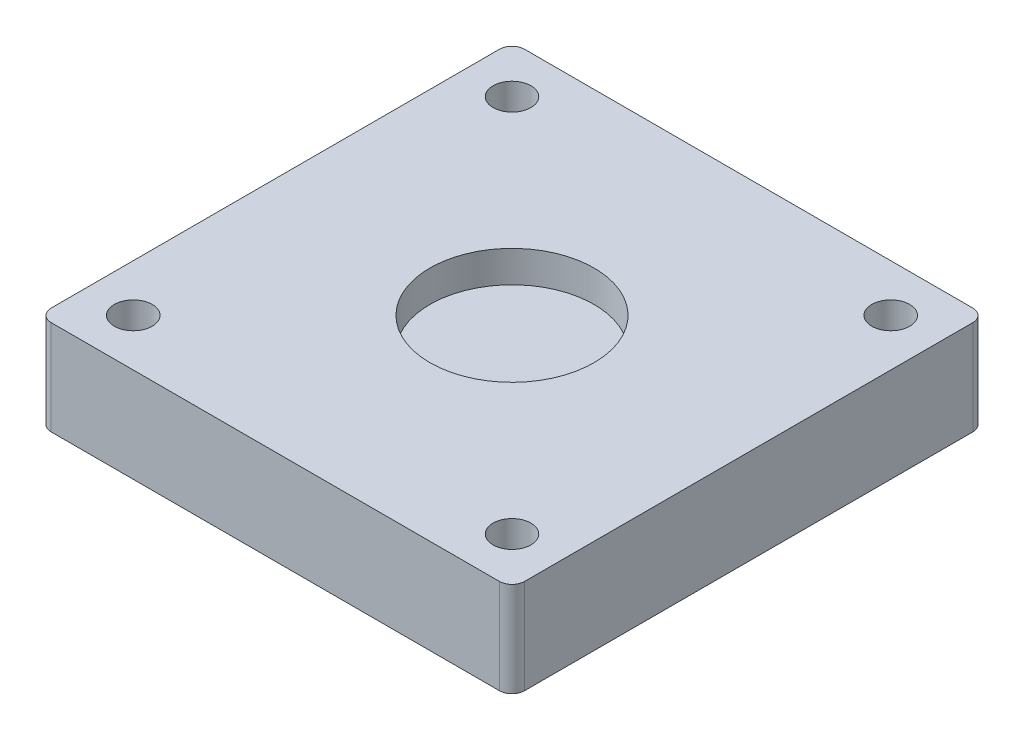
ISO-10303-21;
HEADER;
FILE_DESCRIPTION(('STEP AP214'),'2;1');
FILE_NAME('part.step','',(''),(''),'','','');
FILE_SCHEMA(('AUTOMOTIVE_DESIGN { 1 0 10303 214 1 1 1 1 }'));
ENDSEC;
DATA;
#1=APPLICATION_CONTEXT('core data for automotive mechanical design processes');
#2=APPLICATION_PROTOCOL_DEFINITION('international standard','automotive_design',2000,#1);
#3=PRODUCT_CONTEXT('',#1,'mechanical');
#4=PRODUCT('Part','Part','',(#3));
#5=PRODUCT_RELATED_PRODUCT_CATEGORY('part','',(#4));
#6=PRODUCT_DEFINITION_FORMATION('','',#4);
#7=PRODUCT_DEFINITION_CONTEXT('part definition',#1,'design');
#8=PRODUCT_DEFINITION('design','',#6,#7);
#9=PRODUCT_DEFINITION_SHAPE('','',#8);
#10=(LENGTH_UNIT() NAMED_UNIT(*) SI_UNIT(.MILLI.,.METRE.));
#11=(NAMED_UNIT(*) PLANE_ANGLE_UNIT() SI_UNIT($,.RADIAN.));
#12=(NAMED_UNIT(*) SI_UNIT($,.STERADIAN.) SOLID_ANGLE_UNIT());
#13=UNCERTAINTY_MEASURE_WITH_UNIT(LENGTH_MEASURE(1.E-05),#10,'distance_accuracy_value','');
#14=(GEOMETRIC_REPRESENTATION_CONTEXT(3) GLOBAL_UNCERTAINTY_ASSIGNED_CONTEXT((#13)) GLOBAL_UNIT_ASSIGNED_CONTEXT((#10,
#11,#12)) REPRESENTATION_CONTEXT('',''));
#15=CARTESIAN_POINT('',(0.,0.,0.));
#16=DIRECTION('',(0.,0.,1.));
#17=DIRECTION('',(1.,0.,0.));
#18=AXIS2_PLACEMENT_3D('',#15,#16,#17);
#19=CARTESIAN_POINT('',(37.5,7.5,37.5));
#20=DIRECTION('',(-1.,0.,0.));
#21=DIRECTION('',(0.,0.,1.));
#22=AXIS2_PLACEMENT_3D('',#19,#20,#21);
#23=PLANE('',#22);
#24=DIRECTION('',(0.,0.,-1.));
#25=VECTOR('',#24,1.);
#26=CARTESIAN_POINT('',(37.5,7.5,37.5));
#27=LINE('',#26,#25);
#28=CARTESIAN_POINT('',(37.5,7.5,35.5));
#29=VERTEX_POINT('',#28);
#30=CARTESIAN_POINT('',(37.5,7.5,-35.5));
#31=VERTEX_POINT('',#30);
#32=EDGE_CURVE('E146',#29,#31,#27,.T.);
#33=ORIENTED_EDGE('',*,*,#32,.F.);
#34=DIRECTION('',(0.,1.,0.));
#35=VECTOR('',#34,1.);
#36=CARTESIAN_POINT('',(37.5,-7.5,35.5));
#37=LINE('',#36,#35);
#38=CARTESIAN_POINT('',(37.5,-7.5,35.5));
#39=VERTEX_POINT('',#38);
#40=EDGE_CURVE('E103',#29,#39,#37,.F.);
#41=ORIENTED_EDGE('',*,*,#40,.T.);
#42=DIRECTION('',(0.,0.,-1.));
#43=VECTOR('',#42,1.);
#44=CARTESIAN_POINT('',(37.5,-7.5,37.5));
#45=LINE('',#44,#43);
#46=CARTESIAN_POINT('',(37.5,-7.5,-35.5));
#47=VERTEX_POINT('',#46);
#48=EDGE_CURVE('E127',#39,#47,#45,.T.);
#49=ORIENTED_EDGE('',*,*,#48,.T.);
#50=DIRECTION('',(0.,1.,0.));
#51=VECTOR('',#50,1.);
#52=CARTESIAN_POINT('',(37.5,7.5,-35.5));
#53=LINE('',#52,#51);
#54=EDGE_CURVE('E108',#47,#31,#53,.T.);
#55=ORIENTED_EDGE('',*,*,#54,.T.);
#56=EDGE_LOOP('',(#33,#41,#49,#55));
#57=FACE_BOUND('',#56,.T.);
#58=ADVANCED_FACE('F32',(#57),#23,.F.);
#59=CARTESIAN_POINT('',(-37.5,7.5,37.5));
#60=DIRECTION('',(0.,-1.,0.));
#61=DIRECTION('',(0.,0.,-1.));
#62=AXIS2_PLACEMENT_3D('',#59,#60,#61);
#63=PLANE('',#62);
#64=CARTESIAN_POINT('',(-30.,7.5,-30.));
#65=DIRECTION('',(0.,1.,0.));
#66=DIRECTION('',(0.,0.,1.));
#67=AXIS2_PLACEMENT_3D('',#64,#65,#66);
#68=CIRCLE('',#67,3.);
#69=CARTESIAN_POINT('',(-30.,7.5,-27.));
#70=VERTEX_POINT('',#69);
#71=EDGE_CURVE('E434',#70,#70,#68,.T.);
#72=ORIENTED_EDGE('',*,*,#71,.F.);
#73=EDGE_LOOP('',(#72));
#74=FACE_BOUND('',#73,.T.);
#75=CARTESIAN_POINT('',(-30.,7.5,30.));
#76=DIRECTION('',(0.,1.,0.));
#77=DIRECTION('',(0.,0.,-1.));
#78=AXIS2_PLACEMENT_3D('',#75,#76,#77);
#79=CIRCLE('',#78,3.);
#80=CARTESIAN_POINT('',(-30.,7.5,27.));
#81=VERTEX_POINT('',#80);
#82=EDGE_CURVE('E440',#81,#81,#79,.T.);
#83=ORIENTED_EDGE('',*,*,#82,.F.);
#84=EDGE_LOOP('',(#83));
#85=FACE_BOUND('',#84,.T.);
#86=CARTESIAN_POINT('',(30.,7.5,30.));
#87=DIRECTION('',(0.,1.,0.));
#88=DIRECTION('',(0.,0.,1.));
#89=AXIS2_PLACEMENT_3D('',#86,#87,#88);
#90=CIRCLE('',#89,3.);
#91=CARTESIAN_POINT('',(30.,7.5,33.));
#92=VERTEX_POINT('',#91);
#93=EDGE_CURVE('E446',#92,#92,#90,.T.);
#94=ORIENTED_EDGE('',*,*,#93,.F.);
#95=EDGE_LOOP('',(#94));
#96=FACE_BOUND('',#95,.T.);
#97=CARTESIAN_POINT('',(30.,7.5,-30.));
#98=DIRECTION('',(0.,1.,0.));
#99=DIRECTION('',(0.,0.,-1.));
#100=AXIS2_PLACEMENT_3D('',#97,#98,#99);
#101=CIRCLE('',#100,3.);
#102=CARTESIAN_POINT('',(30.,7.5,-33.));
#103=VERTEX_POINT('',#102);
#104=EDGE_CURVE('E419',#103,#103,#101,.T.);
#105=ORIENTED_EDGE('',*,*,#104,.F.);
#106=EDGE_LOOP('',(#105));
#107=FACE_BOUND('',#106,.T.);
#108=CARTESIAN_POINT('',(0.,7.5,0.));
#109=DIRECTION('',(0.,1.,0.));
#110=DIRECTION('',(0.,0.,1.));
#111=AXIS2_PLACEMENT_3D('',#108,#109,#110);
#112=CIRCLE('',#111,13.);
#113=CARTESIAN_POINT('',(0.,7.5,13.));
#114=VERTEX_POINT('',#113);
#115=EDGE_CURVE('E133',#114,#114,#112,.T.);
#116=ORIENTED_EDGE('',*,*,#115,.F.);
#117=EDGE_LOOP('',(#116));
#118=FACE_BOUND('',#117,.T.);
#119=DIRECTION('',(-1.,0.,0.));
#120=VECTOR('',#119,1.);
#121=CARTESIAN_POINT('',(-37.5,7.5,37.5));
#122=LINE('',#121,#120);
#123=CARTESIAN_POINT('',(35.5,7.5,37.5));
#124=VERTEX_POINT('',#123);
#125=CARTESIAN_POINT('',(-35.5,7.5,37.5));
#126=VERTEX_POINT('',#125);
#127=EDGE_CURVE('E116',#124,#126,#122,.T.);
#128=ORIENTED_EDGE('',*,*,#127,.F.);
#129=CARTESIAN_POINT('',(35.5,7.5,35.5));
#130=DIRECTION('',(0.,-1.,0.));
#131=DIRECTION('',(0.,0.,-1.));
#132=AXIS2_PLACEMENT_3D('',#129,#130,#131);
#133=CIRCLE('',#132,2.);
#134=EDGE_CURVE('E98',#124,#29,#133,.F.);
#135=ORIENTED_EDGE('',*,*,#134,.T.);
#136=ORIENTED_EDGE('',*,*,#32,.T.);
#137=CARTESIAN_POINT('',(35.5,7.5,-35.5));
#138=DIRECTION('',(0.,-1.,0.));
#139=DIRECTION('',(0.,0.,-1.));
#140=AXIS2_PLACEMENT_3D('',#137,#138,#139);
#141=CIRCLE('',#140,2.);
#142=CARTESIAN_POINT('',(35.5,7.5,-37.5));
#143=VERTEX_POINT('',#142);
#144=EDGE_CURVE('E109',#31,#143,#141,.F.);
#145=ORIENTED_EDGE('',*,*,#144,.T.);
#146=DIRECTION('',(-1.,0.,0.));
#147=VECTOR('',#146,1.);
#148=CARTESIAN_POINT('',(-37.5,7.5,-37.5));
#149=LINE('',#148,#147);
#150=CARTESIAN_POINT('',(-35.5,7.5,-37.5));
#151=VERTEX_POINT('',#150);
#152=EDGE_CURVE('E130',#143,#151,#149,.T.);
#153=ORIENTED_EDGE('',*,*,#152,.T.);
#154=CARTESIAN_POINT('',(-35.5,7.5,-35.5));
#155=DIRECTION('',(0.,-1.,0.));
#156=DIRECTION('',(0.,0.,-1.));
#157=AXIS2_PLACEMENT_3D('',#154,#155,#156);
#158=CIRCLE('',#157,2.);
#159=CARTESIAN_POINT('',(-37.5,7.5,-35.5));
#160=VERTEX_POINT('',#159);
#161=EDGE_CURVE('E150',#151,#160,#158,.F.);
#162=ORIENTED_EDGE('',*,*,#161,.T.);
#163=DIRECTION('',(0.,0.,-1.));
#164=VECTOR('',#163,1.);
#165=CARTESIAN_POINT('',(-37.5,7.5,37.5));
#166=LINE('',#165,#164);
#167=CARTESIAN_POINT('',(-37.5,7.5,35.5));
#168=VERTEX_POINT('',#167);
#169=EDGE_CURVE('E143',#168,#160,#166,.T.);
#170=ORIENTED_EDGE('',*,*,#169,.F.);
#171=CARTESIAN_POINT('',(-35.5,7.5,35.5));
#172=DIRECTION('',(0.,-1.,0.));
#173=DIRECTION('',(0.,0.,-1.));
#174=AXIS2_PLACEMENT_3D('',#171,#172,#173);
#175=CIRCLE('',#174,2.);
#176=EDGE_CURVE('E119',#168,#126,#175,.F.);
#177=ORIENTED_EDGE('',*,*,#176,.T.);
#178=EDGE_LOOP('',(#128,#135,#136,#145,#153,#162,#170,#177));
#179=FACE_BOUND('',#178,.T.);
#180=ADVANCED_FACE('F122',(#74,#85,#96,#107,#118,#179),#63,.F.);
#181=CARTESIAN_POINT('',(-37.5,7.5,37.5));
#182=DIRECTION('',(1.,0.,0.));
#183=DIRECTION('',(0.,1.,0.));
#184=AXIS2_PLACEMENT_3D('',#181,#182,#183);
#185=PLANE('',#184);
#186=ORIENTED_EDGE('',*,*,#169,.T.);
#187=DIRECTION('',(0.,-1.,0.));
#188=VECTOR('',#187,1.);
#189=CARTESIAN_POINT('',(-37.5,7.5,-35.5));
#190=LINE('',#189,#188);
#191=CARTESIAN_POINT('',(-37.5,-7.5,-35.5));
#192=VERTEX_POINT('',#191);
#193=EDGE_CURVE('E11',#160,#192,#190,.T.);
#194=ORIENTED_EDGE('',*,*,#193,.T.);
#195=DIRECTION('',(0.,0.,-1.));
#196=VECTOR('',#195,1.);
#197=CARTESIAN_POINT('',(-37.5,-7.5,37.5));
#198=LINE('',#197,#196);
#199=CARTESIAN_POINT('',(-37.5,-7.5,35.5));
#200=VERTEX_POINT('',#199);
#201=EDGE_CURVE('E141',#200,#192,#198,.T.);
#202=ORIENTED_EDGE('',*,*,#201,.F.);
#203=DIRECTION('',(0.,-1.,0.));
#204=VECTOR('',#203,1.);
#205=CARTESIAN_POINT('',(-37.5,7.5,35.5));
#206=LINE('',#205,#204);
#207=EDGE_CURVE('E40',#200,#168,#206,.F.);
#208=ORIENTED_EDGE('',*,*,#207,.T.);
#209=EDGE_LOOP('',(#186,#194,#202,#208));
#210=FACE_BOUND('',#209,.T.);
#211=ADVANCED_FACE('F167',(#210),#185,.F.);
#212=CARTESIAN_POINT('',(-37.5,-7.5,37.5));
#213=DIRECTION('',(0.,1.,0.));
#214=DIRECTION('',(0.,0.,1.));
#215=AXIS2_PLACEMENT_3D('',#212,#213,#214);
#216=PLANE('',#215);
#217=CARTESIAN_POINT('',(30.,-7.5,-30.));
#218=DIRECTION('',(0.,1.,0.));
#219=DIRECTION('',(0.,0.,1.));
#220=AXIS2_PLACEMENT_3D('',#217,#218,#219);
#221=CIRCLE('',#220,2.);
#222=CARTESIAN_POINT('',(30.,-7.5,-28.));
#223=VERTEX_POINT('',#222);
#224=EDGE_CURVE('E407',#223,#223,#221,.T.);
#225=ORIENTED_EDGE('',*,*,#224,.T.);
#226=EDGE_LOOP('',(#225));
#227=FACE_BOUND('',#226,.T.);
#228=CARTESIAN_POINT('',(30.,-7.5,30.));
#229=DIRECTION('',(0.,1.,0.));
#230=DIRECTION('',(0.,0.,1.));
#231=AXIS2_PLACEMENT_3D('',#228,#229,#230);
#232=CIRCLE('',#231,2.);
#233=CARTESIAN_POINT('',(30.,-7.5,32.));
#234=VERTEX_POINT('',#233);
#235=EDGE_CURVE('E411',#234,#234,#232,.T.);
#236=ORIENTED_EDGE('',*,*,#235,.T.);
#237=EDGE_LOOP('',(#236));
#238=FACE_BOUND('',#237,.T.);
#239=CARTESIAN_POINT('',(-30.,-7.5,30.));
#240=DIRECTION('',(0.,1.,0.));
#241=DIRECTION('',(0.,0.,1.));
#242=AXIS2_PLACEMENT_3D('',#239,#240,#241);
#243=CIRCLE('',#242,2.);
#244=CARTESIAN_POINT('',(-30.,-7.5,32.));
#245=VERTEX_POINT('',#244);
#246=EDGE_CURVE('E415',#245,#245,#243,.T.);
#247=ORIENTED_EDGE('',*,*,#246,.T.);
#248=EDGE_LOOP('',(#247));
#249=FACE_BOUND('',#248,.T.);
#250=CARTESIAN_POINT('',(-30.,-7.5,-30.));
#251=DIRECTION('',(0.,1.,0.));
#252=DIRECTION('',(0.,0.,1.));
#253=AXIS2_PLACEMENT_3D('',#250,#251,#252);
#254=CIRCLE('',#253,2.);
#255=CARTESIAN_POINT('',(-30.,-7.5,-28.));
#256=VERTEX_POINT('',#255);
#257=EDGE_CURVE('E418',#256,#256,#254,.T.);
#258=ORIENTED_EDGE('',*,*,#257,.T.);
#259=EDGE_LOOP('',(#258));
#260=FACE_BOUND('',#259,.T.);
#261=ORIENTED_EDGE('',*,*,#48,.F.);
#262=CARTESIAN_POINT('',(35.5,-7.5,35.5));
#263=DIRECTION('',(0.,1.,0.));
#264=DIRECTION('',(0.,0.,1.));
#265=AXIS2_PLACEMENT_3D('',#262,#263,#264);
#266=CIRCLE('',#265,2.);
#267=CARTESIAN_POINT('',(35.5,-7.5,37.5));
#268=VERTEX_POINT('',#267);
#269=EDGE_CURVE('E160',#39,#268,#266,.F.);
#270=ORIENTED_EDGE('',*,*,#269,.T.);
#271=DIRECTION('',(1.,0.,0.));
#272=VECTOR('',#271,1.);
#273=CARTESIAN_POINT('',(-37.5,-7.5,37.5));
#274=LINE('',#273,#272);
#275=CARTESIAN_POINT('',(-35.5,-7.5,37.5));
#276=VERTEX_POINT('',#275);
#277=EDGE_CURVE('E118',#276,#268,#274,.T.);
#278=ORIENTED_EDGE('',*,*,#277,.F.);
#279=CARTESIAN_POINT('',(-35.5,-7.5,35.5));
#280=DIRECTION('',(0.,1.,0.));
#281=DIRECTION('',(0.,0.,1.));
#282=AXIS2_PLACEMENT_3D('',#279,#280,#281);
#283=CIRCLE('',#282,2.);
#284=EDGE_CURVE('E54',#276,#200,#283,.F.);
#285=ORIENTED_EDGE('',*,*,#284,.T.);
#286=ORIENTED_EDGE('',*,*,#201,.T.);
#287=CARTESIAN_POINT('',(-35.5,-7.5,-35.5));
#288=DIRECTION('',(0.,1.,0.));
#289=DIRECTION('',(0.,0.,1.));
#290=AXIS2_PLACEMENT_3D('',#287,#288,#289);
#291=CIRCLE('',#290,2.);
#292=CARTESIAN_POINT('',(-35.5,-7.5,-37.5));
#293=VERTEX_POINT('',#292);
#294=EDGE_CURVE('E47',#192,#293,#291,.F.);
#295=ORIENTED_EDGE('',*,*,#294,.T.);
#296=DIRECTION('',(1.,0.,0.));
#297=VECTOR('',#296,1.);
#298=CARTESIAN_POINT('',(-37.5,-7.5,-37.5));
#299=LINE('',#298,#297);
#300=CARTESIAN_POINT('',(35.5,-7.5,-37.5));
#301=VERTEX_POINT('',#300);
#302=EDGE_CURVE('E125',#293,#301,#299,.T.);
#303=ORIENTED_EDGE('',*,*,#302,.T.);
#304=CARTESIAN_POINT('',(35.5,-7.5,-35.5));
#305=DIRECTION('',(0.,1.,0.));
#306=DIRECTION('',(0.,0.,1.));
#307=AXIS2_PLACEMENT_3D('',#304,#305,#306);
#308=CIRCLE('',#307,2.);
#309=EDGE_CURVE('E158',#301,#47,#308,.F.);
#310=ORIENTED_EDGE('',*,*,#309,.T.);
#311=EDGE_LOOP('',(#261,#270,#278,#285,#286,#295,#303,#310));
#312=FACE_BOUND('',#311,.T.);
#313=ADVANCED_FACE('F171',(#227,#238,#249,#260,#312),#216,.F.);
#314=CARTESIAN_POINT('',(0.,0.,37.5));
#315=DIRECTION('',(0.,0.,1.));
#316=DIRECTION('',(1.,0.,0.));
#317=AXIS2_PLACEMENT_3D('',#314,#315,#316);
#318=PLANE('',#317);
#319=ORIENTED_EDGE('',*,*,#277,.T.);
#320=DIRECTION('',(0.,1.,0.));
#321=VECTOR('',#320,1.);
#322=CARTESIAN_POINT('',(35.5,7.5,37.5));
#323=LINE('',#322,#321);
#324=EDGE_CURVE('E102',#268,#124,#323,.T.);
#325=ORIENTED_EDGE('',*,*,#324,.T.);
#326=ORIENTED_EDGE('',*,*,#127,.T.);
#327=DIRECTION('',(0.,-1.,0.));
#328=VECTOR('',#327,1.);
#329=CARTESIAN_POINT('',(-35.5,-7.5,37.5));
#330=LINE('',#329,#328);
#331=EDGE_CURVE('E120',#126,#276,#330,.T.);
#332=ORIENTED_EDGE('',*,*,#331,.T.);
#333=EDGE_LOOP('',(#319,#325,#326,#332));
#334=FACE_BOUND('',#333,.T.);
#335=ADVANCED_FACE('F114',(#334),#318,.T.);
#336=CARTESIAN_POINT('',(0.,0.,-37.5));
#337=DIRECTION('',(0.,0.,1.));
#338=DIRECTION('',(1.,0.,0.));
#339=AXIS2_PLACEMENT_3D('',#336,#337,#338);
#340=PLANE('',#339);
#341=ORIENTED_EDGE('',*,*,#152,.F.);
#342=DIRECTION('',(0.,1.,0.));
#343=VECTOR('',#342,1.);
#344=CARTESIAN_POINT('',(35.5,0.,-37.5));
#345=LINE('',#344,#343);
#346=EDGE_CURVE('E164',#143,#301,#345,.F.);
#347=ORIENTED_EDGE('',*,*,#346,.T.);
#348=ORIENTED_EDGE('',*,*,#302,.F.);
#349=DIRECTION('',(0.,-1.,0.));
#350=VECTOR('',#349,1.);
#351=CARTESIAN_POINT('',(-35.5,0.,-37.5));
#352=LINE('',#351,#350);
#353=EDGE_CURVE('E162',#293,#151,#352,.F.);
#354=ORIENTED_EDGE('',*,*,#353,.T.);
#355=EDGE_LOOP('',(#341,#347,#348,#354));
#356=FACE_BOUND('',#355,.T.);
#357=ADVANCED_FACE('F180',(#356),#340,.F.);
#358=CARTESIAN_POINT('',(0.,2.5,0.));
#359=DIRECTION('',(0.,1.,0.));
#360=DIRECTION('',(0.,0.,1.));
#361=AXIS2_PLACEMENT_3D('',#358,#359,#360);
#362=CYLINDRICAL_SURFACE('',#361,13.);
#363=CARTESIAN_POINT('',(0.,2.5,0.));
#364=DIRECTION('',(0.,1.,0.));
#365=DIRECTION('',(0.,0.,1.));
#366=AXIS2_PLACEMENT_3D('',#363,#364,#365);
#367=CIRCLE('',#366,13.);
#368=CARTESIAN_POINT('',(0.,2.5,13.));
#369=VERTEX_POINT('',#368);
#370=EDGE_CURVE('E137',#369,#369,#367,.T.);
#371=ORIENTED_EDGE('',*,*,#370,.F.);
#372=EDGE_LOOP('',(#371));
#373=FACE_BOUND('',#372,.T.);
#374=ORIENTED_EDGE('',*,*,#115,.T.);
#375=EDGE_LOOP('',(#374));
#376=FACE_BOUND('',#375,.T.);
#377=ADVANCED_FACE('F257',(#373,#376),#362,.F.);
#378=CARTESIAN_POINT('',(0.,2.5,0.));
#379=DIRECTION('',(0.,1.,0.));
#380=DIRECTION('',(0.,0.,1.));
#381=AXIS2_PLACEMENT_3D('',#378,#379,#380);
#382=PLANE('',#381);
#383=ORIENTED_EDGE('',*,*,#370,.T.);
#384=EDGE_LOOP('',(#383));
#385=FACE_BOUND('',#384,.T.);
#386=ADVANCED_FACE('F253',(#385),#382,.T.);
#387=CARTESIAN_POINT('',(30.,2.5,-30.));
#388=DIRECTION('',(0.,1.,0.));
#389=DIRECTION('',(0.,0.,1.));
#390=AXIS2_PLACEMENT_3D('',#387,#388,#389);
#391=CYLINDRICAL_SURFACE('',#390,3.);
#392=CARTESIAN_POINT('',(30.,2.5,-30.));
#393=DIRECTION('',(0.,1.,0.));
#394=DIRECTION('',(0.,0.,-1.));
#395=AXIS2_PLACEMENT_3D('',#392,#393,#394);
#396=CIRCLE('',#395,3.);
#397=CARTESIAN_POINT('',(30.,2.5,-33.));
#398=VERTEX_POINT('',#397);
#399=EDGE_CURVE('E423',#398,#398,#396,.T.);
#400=ORIENTED_EDGE('',*,*,#399,.F.);
#401=EDGE_LOOP('',(#400));
#402=FACE_BOUND('',#401,.T.);
#403=ORIENTED_EDGE('',*,*,#104,.T.);
#404=EDGE_LOOP('',(#403));
#405=FACE_BOUND('',#404,.T.);
#406=ADVANCED_FACE('F249',(#402,#405),#391,.F.);
#407=CARTESIAN_POINT('',(30.,2.5,-30.));
#408=DIRECTION('',(0.,-1.,0.));
#409=DIRECTION('',(0.,0.,-1.));
#410=AXIS2_PLACEMENT_3D('',#407,#408,#409);
#411=PLANE('',#410);
#412=CARTESIAN_POINT('',(30.,2.5,-30.));
#413=DIRECTION('',(0.,1.,0.));
#414=DIRECTION('',(0.,0.,1.));
#415=AXIS2_PLACEMENT_3D('',#412,#413,#414);
#416=CIRCLE('',#415,2.);
#417=CARTESIAN_POINT('',(30.,2.5,-28.));
#418=VERTEX_POINT('',#417);
#419=EDGE_CURVE('E481',#418,#418,#416,.T.);
#420=ORIENTED_EDGE('',*,*,#419,.F.);
#421=EDGE_LOOP('',(#420));
#422=FACE_BOUND('',#421,.T.);
#423=ORIENTED_EDGE('',*,*,#399,.T.);
#424=EDGE_LOOP('',(#423));
#425=FACE_BOUND('',#424,.T.);
#426=ADVANCED_FACE('F245',(#422,#425),#411,.F.);
#427=CARTESIAN_POINT('',(30.,2.5,30.));
#428=DIRECTION('',(0.,1.,0.));
#429=DIRECTION('',(0.,0.,1.));
#430=AXIS2_PLACEMENT_3D('',#427,#428,#429);
#431=CYLINDRICAL_SURFACE('',#430,3.);
#432=CARTESIAN_POINT('',(30.,2.5,30.));
#433=DIRECTION('',(0.,1.,0.));
#434=DIRECTION('',(0.,0.,1.));
#435=AXIS2_PLACEMENT_3D('',#432,#433,#434);
#436=CIRCLE('',#435,3.);
#437=CARTESIAN_POINT('',(30.,2.5,33.));
#438=VERTEX_POINT('',#437);
#439=EDGE_CURVE('E443',#438,#438,#436,.T.);
#440=ORIENTED_EDGE('',*,*,#439,.F.);
#441=EDGE_LOOP('',(#440));
#442=FACE_BOUND('',#441,.T.);
#443=ORIENTED_EDGE('',*,*,#93,.T.);
#444=EDGE_LOOP('',(#443));
#445=FACE_BOUND('',#444,.T.);
#446=ADVANCED_FACE('F241',(#442,#445),#431,.F.);
#447=CARTESIAN_POINT('',(30.,2.5,30.));
#448=DIRECTION('',(0.,1.,0.));
#449=DIRECTION('',(0.,0.,1.));
#450=AXIS2_PLACEMENT_3D('',#447,#448,#449);
#451=PLANE('',#450);
#452=CARTESIAN_POINT('',(30.,2.5,30.));
#453=DIRECTION('',(0.,1.,0.));
#454=DIRECTION('',(0.,0.,1.));
#455=AXIS2_PLACEMENT_3D('',#452,#453,#454);
#456=CIRCLE('',#455,2.);
#457=CARTESIAN_POINT('',(30.,2.5,32.));
#458=VERTEX_POINT('',#457);
#459=EDGE_CURVE('E477',#458,#458,#456,.T.);
#460=ORIENTED_EDGE('',*,*,#459,.F.);
#461=EDGE_LOOP('',(#460));
#462=FACE_BOUND('',#461,.T.);
#463=ORIENTED_EDGE('',*,*,#439,.T.);
#464=EDGE_LOOP('',(#463));
#465=FACE_BOUND('',#464,.T.);
#466=ADVANCED_FACE('F237',(#462,#465),#451,.T.);
#467=CARTESIAN_POINT('',(-30.,2.5,30.));
#468=DIRECTION('',(0.,1.,0.));
#469=DIRECTION('',(0.,0.,1.));
#470=AXIS2_PLACEMENT_3D('',#467,#468,#469);
#471=CYLINDRICAL_SURFACE('',#470,3.);
#472=CARTESIAN_POINT('',(-30.,2.5,30.));
#473=DIRECTION('',(0.,1.,0.));
#474=DIRECTION('',(0.,0.,-1.));
#475=AXIS2_PLACEMENT_3D('',#472,#473,#474);
#476=CIRCLE('',#475,3.);
#477=CARTESIAN_POINT('',(-30.,2.5,27.));
#478=VERTEX_POINT('',#477);
#479=EDGE_CURVE('E437',#478,#478,#476,.T.);
#480=ORIENTED_EDGE('',*,*,#479,.F.);
#481=EDGE_LOOP('',(#480));
#482=FACE_BOUND('',#481,.T.);
#483=ORIENTED_EDGE('',*,*,#82,.T.);
#484=EDGE_LOOP('',(#483));
#485=FACE_BOUND('',#484,.T.);
#486=ADVANCED_FACE('F233',(#482,#485),#471,.F.);
#487=CARTESIAN_POINT('',(-30.,2.5,30.));
#488=DIRECTION('',(0.,-1.,0.));
#489=DIRECTION('',(0.,0.,-1.));
#490=AXIS2_PLACEMENT_3D('',#487,#488,#489);
#491=PLANE('',#490);
#492=CARTESIAN_POINT('',(-30.,2.5,30.));
#493=DIRECTION('',(0.,1.,0.));
#494=DIRECTION('',(0.,0.,1.));
#495=AXIS2_PLACEMENT_3D('',#492,#493,#494);
#496=CIRCLE('',#495,2.);
#497=CARTESIAN_POINT('',(-30.,2.5,32.));
#498=VERTEX_POINT('',#497);
#499=EDGE_CURVE('E428',#498,#498,#496,.T.);
#500=ORIENTED_EDGE('',*,*,#499,.F.);
#501=EDGE_LOOP('',(#500));
#502=FACE_BOUND('',#501,.T.);
#503=ORIENTED_EDGE('',*,*,#479,.T.);
#504=EDGE_LOOP('',(#503));
#505=FACE_BOUND('',#504,.T.);
#506=ADVANCED_FACE('F229',(#502,#505),#491,.F.);
#507=CARTESIAN_POINT('',(-30.,2.5,-30.));
#508=DIRECTION('',(0.,1.,0.));
#509=DIRECTION('',(0.,0.,1.));
#510=AXIS2_PLACEMENT_3D('',#507,#508,#509);
#511=CYLINDRICAL_SURFACE('',#510,3.);
#512=CARTESIAN_POINT('',(-30.,2.5,-30.));
#513=DIRECTION('',(0.,1.,0.));
#514=DIRECTION('',(0.,0.,1.));
#515=AXIS2_PLACEMENT_3D('',#512,#513,#514);
#516=CIRCLE('',#515,3.);
#517=CARTESIAN_POINT('',(-30.,2.5,-27.));
#518=VERTEX_POINT('',#517);
#519=EDGE_CURVE('E431',#518,#518,#516,.T.);
#520=ORIENTED_EDGE('',*,*,#519,.F.);
#521=EDGE_LOOP('',(#520));
#522=FACE_BOUND('',#521,.T.);
#523=ORIENTED_EDGE('',*,*,#71,.T.);
#524=EDGE_LOOP('',(#523));
#525=FACE_BOUND('',#524,.T.);
#526=ADVANCED_FACE('F225',(#522,#525),#511,.F.);
#527=CARTESIAN_POINT('',(-30.,2.5,-30.));
#528=DIRECTION('',(0.,1.,0.));
#529=DIRECTION('',(0.,0.,1.));
#530=AXIS2_PLACEMENT_3D('',#527,#528,#529);
#531=PLANE('',#530);
#532=CARTESIAN_POINT('',(-30.,2.5,-30.));
#533=DIRECTION('',(0.,1.,0.));
#534=DIRECTION('',(0.,0.,1.));
#535=AXIS2_PLACEMENT_3D('',#532,#533,#534);
#536=CIRCLE('',#535,2.);
#537=CARTESIAN_POINT('',(-30.,2.5,-28.));
#538=VERTEX_POINT('',#537);
#539=EDGE_CURVE('E420',#538,#538,#536,.T.);
#540=ORIENTED_EDGE('',*,*,#539,.F.);
#541=EDGE_LOOP('',(#540));
#542=FACE_BOUND('',#541,.T.);
#543=ORIENTED_EDGE('',*,*,#519,.T.);
#544=EDGE_LOOP('',(#543));
#545=FACE_BOUND('',#544,.T.);
#546=ADVANCED_FACE('F221',(#542,#545),#531,.T.);
#547=CARTESIAN_POINT('',(-30.,-7.5,-30.));
#548=DIRECTION('',(0.,1.,0.));
#549=DIRECTION('',(0.,0.,1.));
#550=AXIS2_PLACEMENT_3D('',#547,#548,#549);
#551=CYLINDRICAL_SURFACE('',#550,2.);
#552=ORIENTED_EDGE('',*,*,#257,.F.);
#553=EDGE_LOOP('',(#552));
#554=FACE_BOUND('',#553,.T.);
#555=ORIENTED_EDGE('',*,*,#539,.T.);
#556=EDGE_LOOP('',(#555));
#557=FACE_BOUND('',#556,.T.);
#558=ADVANCED_FACE('F217',(#554,#557),#551,.F.);
#559=CARTESIAN_POINT('',(-30.,-7.5,30.));
#560=DIRECTION('',(0.,1.,0.));
#561=DIRECTION('',(0.,0.,1.));
#562=AXIS2_PLACEMENT_3D('',#559,#560,#561);
#563=CYLINDRICAL_SURFACE('',#562,2.);
#564=ORIENTED_EDGE('',*,*,#246,.F.);
#565=EDGE_LOOP('',(#564));
#566=FACE_BOUND('',#565,.T.);
#567=ORIENTED_EDGE('',*,*,#499,.T.);
#568=EDGE_LOOP('',(#567));
#569=FACE_BOUND('',#568,.T.);
#570=ADVANCED_FACE('F209',(#566,#569),#563,.F.);
#571=CARTESIAN_POINT('',(30.,-7.5,30.));
#572=DIRECTION('',(0.,1.,0.));
#573=DIRECTION('',(0.,0.,1.));
#574=AXIS2_PLACEMENT_3D('',#571,#572,#573);
#575=CYLINDRICAL_SURFACE('',#574,2.);
#576=ORIENTED_EDGE('',*,*,#235,.F.);
#577=EDGE_LOOP('',(#576));
#578=FACE_BOUND('',#577,.T.);
#579=ORIENTED_EDGE('',*,*,#459,.T.);
#580=EDGE_LOOP('',(#579));
#581=FACE_BOUND('',#580,.T.);
#582=ADVANCED_FACE('F203',(#578,#581),#575,.F.);
#583=CARTESIAN_POINT('',(30.,-7.5,-30.));
#584=DIRECTION('',(0.,1.,0.));
#585=DIRECTION('',(0.,0.,1.));
#586=AXIS2_PLACEMENT_3D('',#583,#584,#585);
#587=CYLINDRICAL_SURFACE('',#586,2.);
#588=ORIENTED_EDGE('',*,*,#224,.F.);
#589=EDGE_LOOP('',(#588));
#590=FACE_BOUND('',#589,.T.);
#591=ORIENTED_EDGE('',*,*,#419,.T.);
#592=EDGE_LOOP('',(#591));
#593=FACE_BOUND('',#592,.T.);
#594=ADVANCED_FACE('F199',(#590,#593),#587,.F.);
#595=CARTESIAN_POINT('',(35.5,0.,35.5));
#596=DIRECTION('',(0.,-1.,0.));
#597=DIRECTION('',(0.,0.,-1.));
#598=AXIS2_PLACEMENT_3D('',#595,#596,#597);
#599=CYLINDRICAL_SURFACE('',#598,2.);
#600=ORIENTED_EDGE('',*,*,#269,.F.);
#601=ORIENTED_EDGE('',*,*,#40,.F.);
#602=ORIENTED_EDGE('',*,*,#134,.F.);
#603=ORIENTED_EDGE('',*,*,#324,.F.);
#604=EDGE_LOOP('',(#600,#601,#602,#603));
#605=FACE_BOUND('',#604,.T.);
#606=ADVANCED_FACE('F101',(#605),#599,.T.);
#607=CARTESIAN_POINT('',(35.5,7.5,-35.5));
#608=DIRECTION('',(0.,1.,0.));
#609=DIRECTION('',(0.,0.,1.));
#610=AXIS2_PLACEMENT_3D('',#607,#608,#609);
#611=CYLINDRICAL_SURFACE('',#610,2.);
#612=ORIENTED_EDGE('',*,*,#309,.F.);
#613=ORIENTED_EDGE('',*,*,#346,.F.);
#614=ORIENTED_EDGE('',*,*,#144,.F.);
#615=ORIENTED_EDGE('',*,*,#54,.F.);
#616=EDGE_LOOP('',(#612,#613,#614,#615));
#617=FACE_BOUND('',#616,.T.);
#618=ADVANCED_FACE('F176',(#617),#611,.T.);
#619=CARTESIAN_POINT('',(-35.5,7.5,-35.5));
#620=DIRECTION('',(0.,-1.,0.));
#621=DIRECTION('',(1.,0.,0.));
#622=AXIS2_PLACEMENT_3D('',#619,#620,#621);
#623=CYLINDRICAL_SURFACE('',#622,2.);
#624=ORIENTED_EDGE('',*,*,#161,.F.);
#625=ORIENTED_EDGE('',*,*,#353,.F.);
#626=ORIENTED_EDGE('',*,*,#294,.F.);
#627=ORIENTED_EDGE('',*,*,#193,.F.);
#628=EDGE_LOOP('',(#624,#625,#626,#627));
#629=FACE_BOUND('',#628,.T.);
#630=ADVANCED_FACE('F182',(#629),#623,.T.);
#631=CARTESIAN_POINT('',(-35.5,0.,35.5));
#632=DIRECTION('',(0.,1.,0.));
#633=DIRECTION('',(-1.,0.,0.));
#634=AXIS2_PLACEMENT_3D('',#631,#632,#633);
#635=CYLINDRICAL_SURFACE('',#634,2.);
#636=ORIENTED_EDGE('',*,*,#176,.F.);
#637=ORIENTED_EDGE('',*,*,#207,.F.);
#638=ORIENTED_EDGE('',*,*,#284,.F.);
#639=ORIENTED_EDGE('',*,*,#331,.F.);
#640=EDGE_LOOP('',(#636,#637,#638,#639));
#641=FACE_BOUND('',#640,.T.);
#642=ADVANCED_FACE('F34',(#641),#635,.T.);
#643=CLOSED_SHELL('',(#58,#180,#211,#313,#335,#357,#377,#386,#406,#426,#446,#466,#486,#506,#526,
#546,#558,#570,#582,#594,#606,#618,#630,#642));
#644=MANIFOLD_SOLID_BREP('B2',#643);
#645=ADVANCED_BREP_SHAPE_REPRESENTATION('',(#18,#644),#14);
#646=SHAPE_DEFINITION_REPRESENTATION(#9,#645);
ENDSEC;
END-ISO-10303-21;
